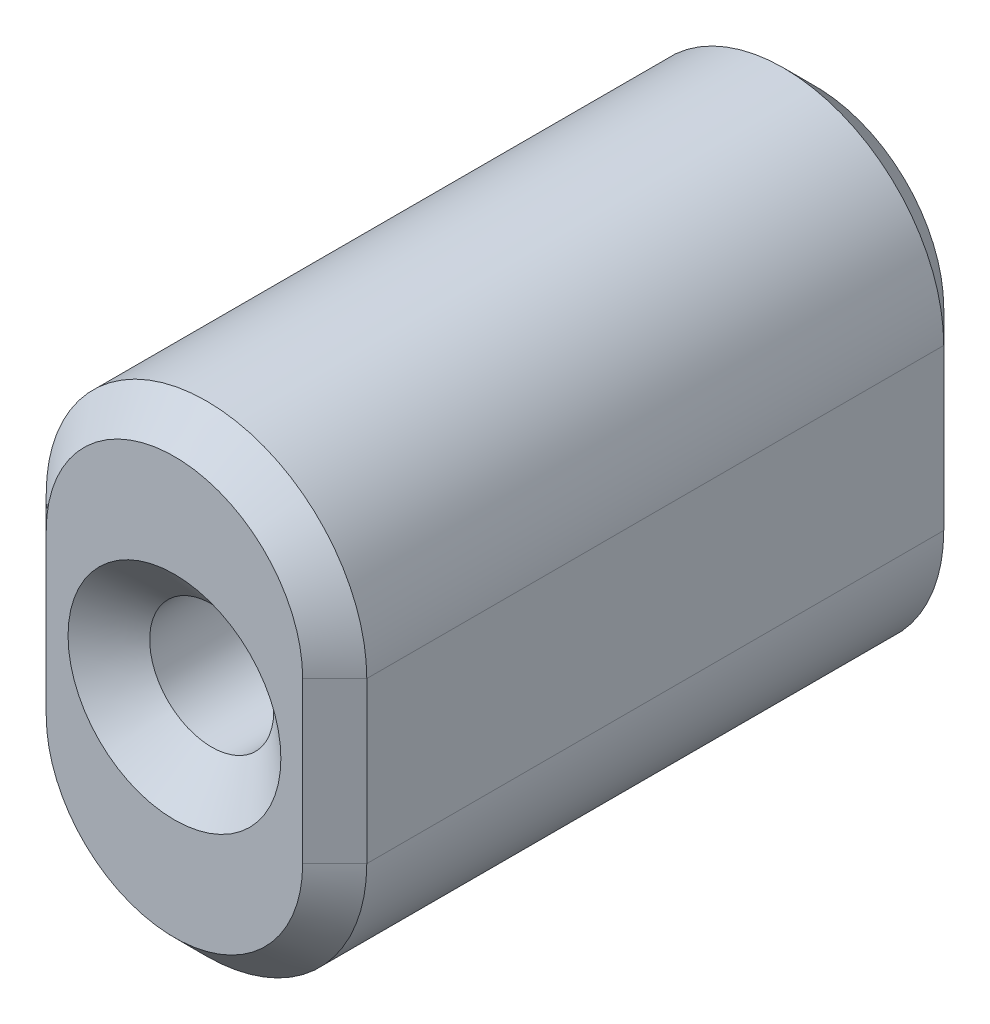
ISO-10303-21;
HEADER;
FILE_DESCRIPTION(('STEP AP214'),'2;1');
FILE_NAME('part.step','',(''),(''),'','','');
FILE_SCHEMA(('AUTOMOTIVE_DESIGN { 1 0 10303 214 1 1 1 1 }'));
ENDSEC;
DATA;
#1=APPLICATION_CONTEXT('core data for automotive mechanical design processes');
#2=APPLICATION_PROTOCOL_DEFINITION('international standard','automotive_design',2000,#1);
#3=PRODUCT_CONTEXT('',#1,'mechanical');
#4=PRODUCT('Part','Part','',(#3));
#5=PRODUCT_RELATED_PRODUCT_CATEGORY('part','',(#4));
#6=PRODUCT_DEFINITION_FORMATION('','',#4);
#7=PRODUCT_DEFINITION_CONTEXT('part definition',#1,'design');
#8=PRODUCT_DEFINITION('design','',#6,#7);
#9=PRODUCT_DEFINITION_SHAPE('','',#8);
#10=(LENGTH_UNIT() NAMED_UNIT(*) SI_UNIT(.MILLI.,.METRE.));
#11=(NAMED_UNIT(*) PLANE_ANGLE_UNIT() SI_UNIT($,.RADIAN.));
#12=(NAMED_UNIT(*) SI_UNIT($,.STERADIAN.) SOLID_ANGLE_UNIT());
#13=UNCERTAINTY_MEASURE_WITH_UNIT(LENGTH_MEASURE(1.E-05),#10,'distance_accuracy_value','');
#14=(GEOMETRIC_REPRESENTATION_CONTEXT(3) GLOBAL_UNCERTAINTY_ASSIGNED_CONTEXT((#13)) GLOBAL_UNIT_ASSIGNED_CONTEXT((#10,
#11,#12)) REPRESENTATION_CONTEXT('',''));
#15=CARTESIAN_POINT('',(0.,0.,0.));
#16=DIRECTION('',(0.,0.,1.));
#17=DIRECTION('',(1.,0.,0.));
#18=AXIS2_PLACEMENT_3D('',#15,#16,#17);
#19=CARTESIAN_POINT('',(2.77555756156289E-13,-3.17500000000021,25.3999999999997));
#20=DIRECTION('',(0.,0.,-0.999999999999994));
#21=DIRECTION('',(-1.00000000000001,0.,0.));
#22=AXIS2_PLACEMENT_3D('',#19,#20,#21);
#23=CYLINDRICAL_SURFACE('',#22,6.35);
#24=DIRECTION('',(0.,0.,-0.999999999999994));
#25=VECTOR('',#24,1.);
#26=CARTESIAN_POINT('',(-6.34999999999972,-3.17500000000026,25.3999999999999));
#27=LINE('',#26,#25);
#28=CARTESIAN_POINT('',(-6.34999999999969,-3.17500000000015,24.1299999999996));
#29=VERTEX_POINT('',#28);
#30=CARTESIAN_POINT('',(-6.34999999999997,-3.17499999999998,1.26999999999974));
#31=VERTEX_POINT('',#30);
#32=EDGE_CURVE('E146',#29,#31,#27,.T.);
#33=ORIENTED_EDGE('',*,*,#32,.T.);
#34=CARTESIAN_POINT('',(4.44089209850063E-13,-3.17500000000032,1.26999999999958));
#35=DIRECTION('',(0.,0.,0.999999999999994));
#36=DIRECTION('',(1.00000000000001,0.,0.));
#37=AXIS2_PLACEMENT_3D('',#34,#35,#36);
#38=CIRCLE('',#37,6.35);
#39=CARTESIAN_POINT('',(6.34999999999986,-3.17500000000043,1.26999999999991));
#40=VERTEX_POINT('',#39);
#41=EDGE_CURVE('E155',#31,#40,#38,.T.);
#42=ORIENTED_EDGE('',*,*,#41,.T.);
#43=DIRECTION('',(0.,0.,-0.999999999999994));
#44=VECTOR('',#43,1.);
#45=CARTESIAN_POINT('',(6.35000000000035,-3.17500000000059,25.3999999999993));
#46=LINE('',#45,#44);
#47=CARTESIAN_POINT('',(6.3500000000003,-3.17500000000026,24.1300000000004));
#48=VERTEX_POINT('',#47);
#49=EDGE_CURVE('E123',#48,#40,#46,.T.);
#50=ORIENTED_EDGE('',*,*,#49,.F.);
#51=CARTESIAN_POINT('',(3.33066907387547E-13,-3.17499999999987,24.1299999999996));
#52=DIRECTION('',(0.,0.,0.999999999999994));
#53=DIRECTION('',(1.00000000000001,0.,0.));
#54=AXIS2_PLACEMENT_3D('',#51,#52,#53);
#55=CIRCLE('',#54,6.35);
#56=EDGE_CURVE('E157',#48,#29,#55,.F.);
#57=ORIENTED_EDGE('',*,*,#56,.T.);
#58=EDGE_LOOP('',(#33,#42,#50,#57));
#59=FACE_BOUND('',#58,.T.);
#60=ADVANCED_FACE('F36',(#59),#23,.T.);
#61=CARTESIAN_POINT('',(6.35000000000035,-3.17500000000059,25.3999999999993));
#62=DIRECTION('',(-1.00000000000001,0.,0.));
#63=DIRECTION('',(0.,-1.,0.));
#64=AXIS2_PLACEMENT_3D('',#61,#62,#63);
#65=PLANE('',#64);
#66=ORIENTED_EDGE('',*,*,#49,.T.);
#67=DIRECTION('',(0.,1.,0.));
#68=VECTOR('',#67,1.);
#69=CARTESIAN_POINT('',(6.34999999999986,-3.17500000000043,1.26999999999991));
#70=LINE('',#69,#68);
#71=CARTESIAN_POINT('',(6.35000000000019,3.17499999999998,1.27000000000063));
#72=VERTEX_POINT('',#71);
#73=EDGE_CURVE('E122',#40,#72,#70,.T.);
#74=ORIENTED_EDGE('',*,*,#73,.T.);
#75=DIRECTION('',(0.,0.,-0.999999999999994));
#76=VECTOR('',#75,1.);
#77=CARTESIAN_POINT('',(6.3500000000003,3.17499999999982,25.3999999999992));
#78=LINE('',#77,#76);
#79=CARTESIAN_POINT('',(6.35000000000013,3.17499999999943,24.1299999999996));
#80=VERTEX_POINT('',#79);
#81=EDGE_CURVE('E105',#80,#72,#78,.T.);
#82=ORIENTED_EDGE('',*,*,#81,.F.);
#83=DIRECTION('',(0.,-1.,0.));
#84=VECTOR('',#83,1.);
#85=CARTESIAN_POINT('',(6.3500000000003,-3.17500000000026,24.1300000000004));
#86=LINE('',#85,#84);
#87=EDGE_CURVE('E119',#80,#48,#86,.T.);
#88=ORIENTED_EDGE('',*,*,#87,.T.);
#89=EDGE_LOOP('',(#66,#74,#82,#88));
#90=FACE_BOUND('',#89,.T.);
#91=ADVANCED_FACE('F118',(#90),#65,.F.);
#92=CARTESIAN_POINT('',(3.88578058618805E-13,3.17499999999965,25.3999999999987));
#93=DIRECTION('',(0.,0.,-0.999999999999994));
#94=DIRECTION('',(-1.00000000000001,0.,0.));
#95=AXIS2_PLACEMENT_3D('',#92,#93,#94);
#96=CYLINDRICAL_SURFACE('',#95,6.35);
#97=ORIENTED_EDGE('',*,*,#81,.T.);
#98=CARTESIAN_POINT('',(3.33066907387547E-13,3.17499999999954,1.2700000000006));
#99=DIRECTION('',(0.,0.,0.999999999999994));
#100=DIRECTION('',(1.00000000000001,0.,0.));
#101=AXIS2_PLACEMENT_3D('',#98,#99,#100);
#102=CIRCLE('',#101,6.35);
#103=CARTESIAN_POINT('',(-6.34999999999958,3.17499999999965,1.27000000000019));
#104=VERTEX_POINT('',#103);
#105=EDGE_CURVE('E111',#72,#104,#102,.T.);
#106=ORIENTED_EDGE('',*,*,#105,.T.);
#107=DIRECTION('',(0.,0.,-0.999999999999994));
#108=VECTOR('',#107,1.);
#109=CARTESIAN_POINT('',(-6.34999999999969,3.17499999999959,25.3999999999999));
#110=LINE('',#109,#108);
#111=CARTESIAN_POINT('',(-6.34999999999958,3.17499999999987,24.1299999999998));
#112=VERTEX_POINT('',#111);
#113=EDGE_CURVE('E107',#112,#104,#110,.T.);
#114=ORIENTED_EDGE('',*,*,#113,.F.);
#115=CARTESIAN_POINT('',(4.71844785465692E-13,3.17499999999998,24.1299999999996));
#116=DIRECTION('',(0.,0.,0.999999999999994));
#117=DIRECTION('',(1.00000000000001,0.,0.));
#118=AXIS2_PLACEMENT_3D('',#115,#116,#117);
#119=CIRCLE('',#118,6.35);
#120=EDGE_CURVE('E102',#112,#80,#119,.F.);
#121=ORIENTED_EDGE('',*,*,#120,.T.);
#122=EDGE_LOOP('',(#97,#106,#114,#121));
#123=FACE_BOUND('',#122,.T.);
#124=ADVANCED_FACE('F104',(#123),#96,.T.);
#125=CARTESIAN_POINT('',(-6.34999999999972,-3.17500000000026,25.3999999999999));
#126=DIRECTION('',(1.00000000000001,0.,0.));
#127=DIRECTION('',(0.,1.,0.));
#128=AXIS2_PLACEMENT_3D('',#125,#126,#127);
#129=PLANE('',#128);
#130=ORIENTED_EDGE('',*,*,#113,.T.);
#131=DIRECTION('',(0.,-1.,0.));
#132=VECTOR('',#131,1.);
#133=CARTESIAN_POINT('',(-6.34999999999997,-3.17499999999998,1.26999999999974));
#134=LINE('',#133,#132);
#135=EDGE_CURVE('E159',#104,#31,#134,.T.);
#136=ORIENTED_EDGE('',*,*,#135,.T.);
#137=ORIENTED_EDGE('',*,*,#32,.F.);
#138=DIRECTION('',(0.,1.,0.));
#139=VECTOR('',#138,1.);
#140=CARTESIAN_POINT('',(-6.34999999999958,3.17499999999987,24.1299999999998));
#141=LINE('',#140,#139);
#142=EDGE_CURVE('E161',#29,#112,#141,.T.);
#143=ORIENTED_EDGE('',*,*,#142,.T.);
#144=EDGE_LOOP('',(#130,#136,#137,#143));
#145=FACE_BOUND('',#144,.T.);
#146=ADVANCED_FACE('F191',(#145),#129,.F.);
#147=CARTESIAN_POINT('',(2.77555756156289E-13,-3.17500000000021,25.3999999999997));
#148=DIRECTION('',(0.,0.,0.999999999999994));
#149=DIRECTION('',(1.00000000000001,0.,0.));
#150=AXIS2_PLACEMENT_3D('',#147,#148,#149);
#151=PLANE('',#150);
#152=CARTESIAN_POINT('',(4.44089209850063E-13,-2.77555756156289E-13,25.3999999999996));
#153=DIRECTION('',(0.,0.,0.999999999999994));
#154=DIRECTION('',(1.00000000000001,0.,0.));
#155=AXIS2_PLACEMENT_3D('',#152,#153,#154);
#156=CIRCLE('',#155,4.2164);
#157=CARTESIAN_POINT('',(4.2164000000005,-2.3771513045451E-13,25.3999999999996));
#158=VERTEX_POINT('',#157);
#159=EDGE_CURVE('E182',#158,#158,#156,.T.);
#160=ORIENTED_EDGE('',*,*,#159,.F.);
#161=EDGE_LOOP('',(#160));
#162=FACE_BOUND('',#161,.T.);
#163=CARTESIAN_POINT('',(3.88578058618805E-13,3.17499999999965,25.3999999999987));
#164=DIRECTION('',(0.,0.,0.999999999999994));
#165=DIRECTION('',(1.00000000000001,0.,0.));
#166=AXIS2_PLACEMENT_3D('',#163,#164,#165);
#167=CIRCLE('',#166,5.08000000000001);
#168=CARTESIAN_POINT('',(5.07999999999997,3.17499999999987,25.3999999999998));
#169=VERTEX_POINT('',#168);
#170=CARTESIAN_POINT('',(-5.07999999999992,3.17499999999971,25.3999999999996));
#171=VERTEX_POINT('',#170);
#172=EDGE_CURVE('E45',#169,#171,#167,.T.);
#173=ORIENTED_EDGE('',*,*,#172,.T.);
#174=DIRECTION('',(0.,-1.,0.));
#175=VECTOR('',#174,1.);
#176=CARTESIAN_POINT('',(-5.07999999999931,-3.17500000000021,25.3999999999995));
#177=LINE('',#176,#175);
#178=CARTESIAN_POINT('',(-5.07999999999931,-3.17500000000021,25.3999999999995));
#179=VERTEX_POINT('',#178);
#180=EDGE_CURVE('E11',#171,#179,#177,.T.);
#181=ORIENTED_EDGE('',*,*,#180,.T.);
#182=CARTESIAN_POINT('',(2.77555756156289E-13,-3.17500000000021,25.3999999999997));
#183=DIRECTION('',(0.,0.,0.999999999999994));
#184=DIRECTION('',(1.00000000000001,0.,0.));
#185=AXIS2_PLACEMENT_3D('',#182,#183,#184);
#186=CIRCLE('',#185,5.08000000000001);
#187=CARTESIAN_POINT('',(5.07999999999997,-3.17500000000059,25.3999999999998));
#188=VERTEX_POINT('',#187);
#189=EDGE_CURVE('E153',#179,#188,#186,.T.);
#190=ORIENTED_EDGE('',*,*,#189,.T.);
#191=DIRECTION('',(0.,1.,0.));
#192=VECTOR('',#191,1.);
#193=CARTESIAN_POINT('',(5.07999999999997,3.17499999999987,25.3999999999998));
#194=LINE('',#193,#192);
#195=EDGE_CURVE('E56',#188,#169,#194,.T.);
#196=ORIENTED_EDGE('',*,*,#195,.T.);
#197=EDGE_LOOP('',(#173,#181,#190,#196));
#198=FACE_BOUND('',#197,.T.);
#199=ADVANCED_FACE('F188',(#162,#198),#151,.T.);
#200=CARTESIAN_POINT('',(0.,-3.17499999999998,-1.94289029309402E-13));
#201=DIRECTION('',(0.,0.,0.999999999999994));
#202=DIRECTION('',(1.00000000000001,0.,0.));
#203=AXIS2_PLACEMENT_3D('',#200,#201,#202);
#204=PLANE('',#203);
#205=CARTESIAN_POINT('',(0.,0.,0.));
#206=DIRECTION('',(0.,0.,0.999999999999994));
#207=DIRECTION('',(1.00000000000001,0.,0.));
#208=AXIS2_PLACEMENT_3D('',#205,#206,#207);
#209=CIRCLE('',#208,2.45744999999999);
#210=CARTESIAN_POINT('',(2.45745000000003,0.,0.));
#211=VERTEX_POINT('',#210);
#212=EDGE_CURVE('E142',#211,#211,#209,.T.);
#213=ORIENTED_EDGE('',*,*,#212,.T.);
#214=EDGE_LOOP('',(#213));
#215=FACE_BOUND('',#214,.T.);
#216=CARTESIAN_POINT('',(2.22044604925031E-13,3.17499999999971,5.82867087928207E-13));
#217=DIRECTION('',(0.,0.,0.999999999999994));
#218=DIRECTION('',(1.00000000000001,0.,0.));
#219=AXIS2_PLACEMENT_3D('',#216,#217,#218);
#220=CIRCLE('',#219,5.08);
#221=CARTESIAN_POINT('',(-5.07999999999956,3.17500000000009,4.44089209850063E-13));
#222=VERTEX_POINT('',#221);
#223=CARTESIAN_POINT('',(5.08000000000047,3.17499999999971,8.60422844084496E-13));
#224=VERTEX_POINT('',#223);
#225=EDGE_CURVE('E166',#222,#224,#220,.F.);
#226=ORIENTED_EDGE('',*,*,#225,.T.);
#227=DIRECTION('',(0.,-1.,0.));
#228=VECTOR('',#227,1.);
#229=CARTESIAN_POINT('',(5.08000000000031,-3.17500000000043,-2.4980018054066E-13));
#230=LINE('',#229,#228);
#231=CARTESIAN_POINT('',(5.08000000000031,-3.17500000000043,-2.4980018054066E-13));
#232=VERTEX_POINT('',#231);
#233=EDGE_CURVE('E112',#224,#232,#230,.T.);
#234=ORIENTED_EDGE('',*,*,#233,.T.);
#235=CARTESIAN_POINT('',(0.,-3.17499999999998,-1.94289029309402E-13));
#236=DIRECTION('',(0.,0.,0.999999999999994));
#237=DIRECTION('',(1.00000000000001,0.,0.));
#238=AXIS2_PLACEMENT_3D('',#235,#236,#237);
#239=CIRCLE('',#238,5.08);
#240=CARTESIAN_POINT('',(-5.07999999999975,-3.17500000000065,-3.33066907387547E-13));
#241=VERTEX_POINT('',#240);
#242=EDGE_CURVE('E170',#232,#241,#239,.F.);
#243=ORIENTED_EDGE('',*,*,#242,.T.);
#244=DIRECTION('',(0.,1.,0.));
#245=VECTOR('',#244,1.);
#246=CARTESIAN_POINT('',(-5.07999999999975,-3.17500000000065,-3.33066907387547E-13));
#247=LINE('',#246,#245);
#248=EDGE_CURVE('E168',#241,#222,#247,.T.);
#249=ORIENTED_EDGE('',*,*,#248,.T.);
#250=EDGE_LOOP('',(#226,#234,#243,#249));
#251=FACE_BOUND('',#250,.T.);
#252=ADVANCED_FACE('F190',(#215,#251),#204,.F.);
#253=CARTESIAN_POINT('',(-6.34999999999997,-3.17499999999998,1.26999999999974));
#254=DIRECTION('',(0.707106781186561,0.,0.707106781186547));
#255=DIRECTION('',(0.,-1.,0.));
#256=AXIS2_PLACEMENT_3D('',#253,#254,#255);
#257=PLANE('',#256);
#258=DIRECTION('',(-0.707106781186551,0.,0.707106781186536));
#259=VECTOR('',#258,1.);
#260=CARTESIAN_POINT('',(-5.07999999999956,3.17500000000009,4.44089209850063E-13));
#261=LINE('',#260,#259);
#262=EDGE_CURVE('E147',#222,#104,#261,.T.);
#263=ORIENTED_EDGE('',*,*,#262,.F.);
#264=ORIENTED_EDGE('',*,*,#248,.F.);
#265=DIRECTION('',(0.707106781186551,0.,-0.707106781186537));
#266=VECTOR('',#265,1.);
#267=CARTESIAN_POINT('',(-6.34999999999997,-3.17499999999998,1.26999999999974));
#268=LINE('',#267,#266);
#269=EDGE_CURVE('E143',#31,#241,#268,.T.);
#270=ORIENTED_EDGE('',*,*,#269,.F.);
#271=ORIENTED_EDGE('',*,*,#135,.F.);
#272=EDGE_LOOP('',(#263,#264,#270,#271));
#273=FACE_BOUND('',#272,.T.);
#274=ADVANCED_FACE('F197',(#273),#257,.F.);
#275=CARTESIAN_POINT('',(4.44089209850063E-13,-3.17500000000032,1.26999999999958));
#276=DIRECTION('',(0.,0.,0.999999999999994));
#277=DIRECTION('',(1.00000000000001,0.,0.));
#278=AXIS2_PLACEMENT_3D('',#275,#276,#277);
#279=CONICAL_SURFACE('',#278,6.35,0.78539816339745);
#280=ORIENTED_EDGE('',*,*,#269,.T.);
#281=ORIENTED_EDGE('',*,*,#242,.F.);
#282=DIRECTION('',(-0.707106781186562,0.,-0.707106781186545));
#283=VECTOR('',#282,1.);
#284=CARTESIAN_POINT('',(6.34999999999986,-3.17500000000043,1.26999999999991));
#285=LINE('',#284,#283);
#286=EDGE_CURVE('E133',#40,#232,#285,.T.);
#287=ORIENTED_EDGE('',*,*,#286,.F.);
#288=ORIENTED_EDGE('',*,*,#41,.F.);
#289=EDGE_LOOP('',(#280,#281,#287,#288));
#290=FACE_BOUND('',#289,.T.);
#291=ADVANCED_FACE('F219',(#290),#279,.T.);
#292=CARTESIAN_POINT('',(3.33066907387547E-13,3.17499999999954,1.2700000000006));
#293=DIRECTION('',(0.,0.,0.999999999999994));
#294=DIRECTION('',(1.00000000000001,0.,0.));
#295=AXIS2_PLACEMENT_3D('',#292,#293,#294);
#296=CONICAL_SURFACE('',#295,6.35,0.78539816339745);
#297=ORIENTED_EDGE('',*,*,#262,.T.);
#298=ORIENTED_EDGE('',*,*,#105,.F.);
#299=DIRECTION('',(0.707106781186562,0.,0.707106781186545));
#300=VECTOR('',#299,1.);
#301=CARTESIAN_POINT('',(5.08000000000047,3.17499999999971,8.60422844084496E-13));
#302=LINE('',#301,#300);
#303=EDGE_CURVE('E132',#224,#72,#302,.T.);
#304=ORIENTED_EDGE('',*,*,#303,.F.);
#305=ORIENTED_EDGE('',*,*,#225,.F.);
#306=EDGE_LOOP('',(#297,#298,#304,#305));
#307=FACE_BOUND('',#306,.T.);
#308=ADVANCED_FACE('F215',(#307),#296,.T.);
#309=CARTESIAN_POINT('',(6.34999999999986,-3.17500000000043,1.26999999999991));
#310=DIRECTION('',(-0.707106781186549,0.,0.70710678118654));
#311=DIRECTION('',(0.,1.,0.));
#312=AXIS2_PLACEMENT_3D('',#309,#310,#311);
#313=PLANE('',#312);
#314=ORIENTED_EDGE('',*,*,#286,.T.);
#315=ORIENTED_EDGE('',*,*,#233,.F.);
#316=ORIENTED_EDGE('',*,*,#303,.T.);
#317=ORIENTED_EDGE('',*,*,#73,.F.);
#318=EDGE_LOOP('',(#314,#315,#316,#317));
#319=FACE_BOUND('',#318,.T.);
#320=ADVANCED_FACE('F212',(#319),#313,.F.);
#321=CARTESIAN_POINT('',(5.07999999999997,-3.17500000000059,25.3999999999998));
#322=DIRECTION('',(0.707106781186562,0.,0.707106781186545));
#323=DIRECTION('',(0.,-1.,0.));
#324=AXIS2_PLACEMENT_3D('',#321,#322,#323);
#325=PLANE('',#324);
#326=DIRECTION('',(-0.70710678118655,0.,0.70710678118654));
#327=VECTOR('',#326,1.);
#328=CARTESIAN_POINT('',(6.3500000000003,-3.17500000000026,24.1300000000004));
#329=LINE('',#328,#327);
#330=EDGE_CURVE('E128',#48,#188,#329,.T.);
#331=ORIENTED_EDGE('',*,*,#330,.F.);
#332=ORIENTED_EDGE('',*,*,#87,.F.);
#333=DIRECTION('',(0.707106781186547,0.,-0.707106781186541));
#334=VECTOR('',#333,1.);
#335=CARTESIAN_POINT('',(5.07999999999997,3.17499999999987,25.3999999999998));
#336=LINE('',#335,#334);
#337=EDGE_CURVE('E40',#169,#80,#336,.T.);
#338=ORIENTED_EDGE('',*,*,#337,.F.);
#339=ORIENTED_EDGE('',*,*,#195,.F.);
#340=EDGE_LOOP('',(#331,#332,#338,#339));
#341=FACE_BOUND('',#340,.T.);
#342=ADVANCED_FACE('F38',(#341),#325,.T.);
#343=CARTESIAN_POINT('',(3.88578058618805E-13,3.17499999999965,25.3999999999987));
#344=DIRECTION('',(0.,0.,-0.999999999999994));
#345=DIRECTION('',(-1.00000000000001,0.,0.));
#346=AXIS2_PLACEMENT_3D('',#343,#344,#345);
#347=CONICAL_SURFACE('',#346,5.08000000000001,0.785398163397446);
#348=ORIENTED_EDGE('',*,*,#337,.T.);
#349=ORIENTED_EDGE('',*,*,#120,.F.);
#350=DIRECTION('',(-0.707106781186559,0.,-0.707106781186548));
#351=VECTOR('',#350,1.);
#352=CARTESIAN_POINT('',(-5.07999999999992,3.17499999999971,25.3999999999996));
#353=LINE('',#352,#351);
#354=EDGE_CURVE('E135',#171,#112,#353,.T.);
#355=ORIENTED_EDGE('',*,*,#354,.F.);
#356=ORIENTED_EDGE('',*,*,#172,.F.);
#357=EDGE_LOOP('',(#348,#349,#355,#356));
#358=FACE_BOUND('',#357,.T.);
#359=ADVANCED_FACE('F131',(#358),#347,.T.);
#360=CARTESIAN_POINT('',(2.77555756156289E-13,-3.17500000000021,25.3999999999997));
#361=DIRECTION('',(0.,0.,-0.999999999999994));
#362=DIRECTION('',(-1.00000000000001,0.,0.));
#363=AXIS2_PLACEMENT_3D('',#360,#361,#362);
#364=CONICAL_SURFACE('',#363,5.08000000000001,0.785398163397446);
#365=ORIENTED_EDGE('',*,*,#330,.T.);
#366=ORIENTED_EDGE('',*,*,#189,.F.);
#367=DIRECTION('',(0.707106781186559,0.,0.707106781186548));
#368=VECTOR('',#367,1.);
#369=CARTESIAN_POINT('',(-6.34999999999969,-3.17500000000015,24.1299999999996));
#370=LINE('',#369,#368);
#371=EDGE_CURVE('E138',#29,#179,#370,.T.);
#372=ORIENTED_EDGE('',*,*,#371,.F.);
#373=ORIENTED_EDGE('',*,*,#56,.F.);
#374=EDGE_LOOP('',(#365,#366,#372,#373));
#375=FACE_BOUND('',#374,.T.);
#376=ADVANCED_FACE('F231',(#375),#364,.T.);
#377=CARTESIAN_POINT('',(-5.07999999999931,-3.17500000000021,25.3999999999995));
#378=DIRECTION('',(-0.707106781186552,0.,0.707106781186538));
#379=DIRECTION('',(0.,1.,0.));
#380=AXIS2_PLACEMENT_3D('',#377,#378,#379);
#381=PLANE('',#380);
#382=ORIENTED_EDGE('',*,*,#354,.T.);
#383=ORIENTED_EDGE('',*,*,#142,.F.);
#384=ORIENTED_EDGE('',*,*,#371,.T.);
#385=ORIENTED_EDGE('',*,*,#180,.F.);
#386=EDGE_LOOP('',(#382,#383,#384,#385));
#387=FACE_BOUND('',#386,.T.);
#388=ADVANCED_FACE('F227',(#387),#381,.T.);
#389=CARTESIAN_POINT('',(4.44089209850063E-13,-2.77555756156289E-13,25.3999999999996));
#390=DIRECTION('',(0.,0.,0.999999999999994));
#391=DIRECTION('',(1.00000000000001,0.,0.));
#392=AXIS2_PLACEMENT_3D('',#389,#390,#391);
#393=CYLINDRICAL_SURFACE('',#392,2.45745);
#394=ORIENTED_EDGE('',*,*,#212,.F.);
#395=EDGE_LOOP('',(#394));
#396=FACE_BOUND('',#395,.T.);
#397=CARTESIAN_POINT('',(2.77555756156289E-13,-4.44089209850063E-13,23.9240657037402));
#398=DIRECTION('',(0.,0.,0.999999999999994));
#399=DIRECTION('',(1.00000000000001,0.,0.));
#400=AXIS2_PLACEMENT_3D('',#397,#398,#399);
#401=CIRCLE('',#400,2.45745);
#402=CARTESIAN_POINT('',(2.45745000000031,-4.20868845171466E-13,23.9240657037402));
#403=VERTEX_POINT('',#402);
#404=EDGE_CURVE('E179',#403,#403,#401,.T.);
#405=ORIENTED_EDGE('',*,*,#404,.T.);
#406=EDGE_LOOP('',(#405));
#407=FACE_BOUND('',#406,.T.);
#408=ADVANCED_FACE('F230',(#396,#407),#393,.F.);
#409=CARTESIAN_POINT('',(4.44089209850063E-13,-2.77555756156289E-13,25.3999999999996));
#410=DIRECTION('',(0.,0.,0.999999999999994));
#411=DIRECTION('',(1.00000000000001,0.,0.));
#412=AXIS2_PLACEMENT_3D('',#409,#410,#411);
#413=CONICAL_SURFACE('',#412,4.2164,0.872664625997165);
#414=ORIENTED_EDGE('',*,*,#404,.F.);
#415=EDGE_LOOP('',(#414));
#416=FACE_BOUND('',#415,.T.);
#417=ORIENTED_EDGE('',*,*,#159,.T.);
#418=EDGE_LOOP('',(#417));
#419=FACE_BOUND('',#418,.T.);
#420=ADVANCED_FACE('F186',(#416,#419),#413,.F.);
#421=CLOSED_SHELL('',(#60,#91,#124,#146,#199,#252,#274,#291,#308,#320,#342,#359,#376,#388,#408,#420));
#422=MANIFOLD_SOLID_BREP('B2',#421);
#423=ADVANCED_BREP_SHAPE_REPRESENTATION('',(#18,#422),#14);
#424=SHAPE_DEFINITION_REPRESENTATION(#9,#423);
ENDSEC;
END-ISO-10303-21;
